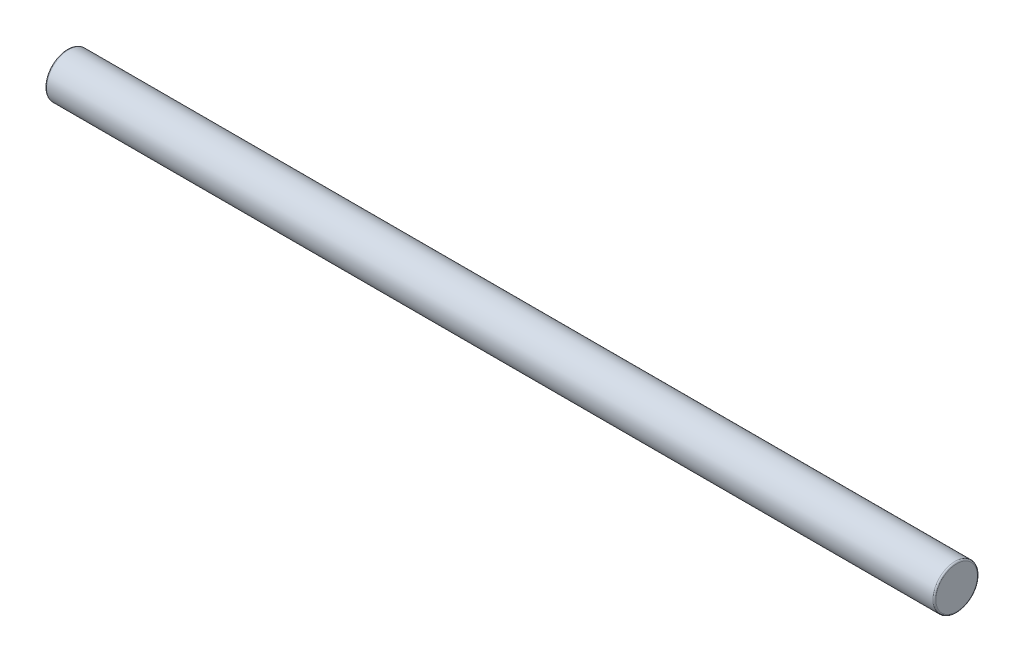
ISO-10303-21;
HEADER;
FILE_DESCRIPTION(('STEP AP214'),'2;1');
FILE_NAME('part.step','',(''),(''),'','','');
FILE_SCHEMA(('AUTOMOTIVE_DESIGN { 1 0 10303 214 1 1 1 1 }'));
ENDSEC;
DATA;
#1=APPLICATION_CONTEXT('core data for automotive mechanical design processes');
#2=APPLICATION_PROTOCOL_DEFINITION('international standard','automotive_design',2000,#1);
#3=PRODUCT_CONTEXT('',#1,'mechanical');
#4=PRODUCT('Part','Part','',(#3));
#5=PRODUCT_RELATED_PRODUCT_CATEGORY('part','',(#4));
#6=PRODUCT_DEFINITION_FORMATION('','',#4);
#7=PRODUCT_DEFINITION_CONTEXT('part definition',#1,'design');
#8=PRODUCT_DEFINITION('design','',#6,#7);
#9=PRODUCT_DEFINITION_SHAPE('','',#8);
#10=(LENGTH_UNIT() NAMED_UNIT(*) SI_UNIT(.MILLI.,.METRE.));
#11=(NAMED_UNIT(*) PLANE_ANGLE_UNIT() SI_UNIT($,.RADIAN.));
#12=(NAMED_UNIT(*) SI_UNIT($,.STERADIAN.) SOLID_ANGLE_UNIT());
#13=UNCERTAINTY_MEASURE_WITH_UNIT(LENGTH_MEASURE(1.E-05),#10,'distance_accuracy_value','');
#14=(GEOMETRIC_REPRESENTATION_CONTEXT(3) GLOBAL_UNCERTAINTY_ASSIGNED_CONTEXT((#13)) GLOBAL_UNIT_ASSIGNED_CONTEXT((#10,
#11,#12)) REPRESENTATION_CONTEXT('',''));
#15=CARTESIAN_POINT('',(0.,0.,0.));
#16=DIRECTION('',(0.,0.,1.));
#17=DIRECTION('',(1.,0.,0.));
#18=AXIS2_PLACEMENT_3D('',#15,#16,#17);
#19=CARTESIAN_POINT('',(15.24,0.,0.));
#20=DIRECTION('',(-1.,0.,0.));
#21=DIRECTION('',(0.,0.,1.));
#22=AXIS2_PLACEMENT_3D('',#19,#20,#21);
#23=CYLINDRICAL_SURFACE('',#22,0.380999999999999);
#24=CARTESIAN_POINT('',(0.0254000000000001,0.,0.));
#25=DIRECTION('',(1.,0.,0.));
#26=DIRECTION('',(0.,0.,-1.));
#27=AXIS2_PLACEMENT_3D('',#24,#25,#26);
#28=CIRCLE('',#27,0.380999999999999);
#29=CARTESIAN_POINT('',(0.0254000000000001,0.,-0.380999999999999));
#30=VERTEX_POINT('',#29);
#31=EDGE_CURVE('E43',#30,#30,#28,.T.);
#32=ORIENTED_EDGE('',*,*,#31,.T.);
#33=EDGE_LOOP('',(#32));
#34=FACE_BOUND('',#33,.T.);
#35=CARTESIAN_POINT('',(15.2146,0.,0.));
#36=DIRECTION('',(1.,0.,0.));
#37=DIRECTION('',(0.,0.,-1.));
#38=AXIS2_PLACEMENT_3D('',#35,#36,#37);
#39=CIRCLE('',#38,0.380999999999999);
#40=CARTESIAN_POINT('',(15.2146,0.,-0.380999999999999));
#41=VERTEX_POINT('',#40);
#42=EDGE_CURVE('E47',#41,#41,#39,.F.);
#43=ORIENTED_EDGE('',*,*,#42,.T.);
#44=EDGE_LOOP('',(#43));
#45=FACE_BOUND('',#44,.T.);
#46=ADVANCED_FACE('F32',(#34,#45),#23,.T.);
#47=CARTESIAN_POINT('',(15.24,0.,0.));
#48=DIRECTION('',(1.,0.,0.));
#49=DIRECTION('',(0.,0.,-1.));
#50=AXIS2_PLACEMENT_3D('',#47,#48,#49);
#51=PLANE('',#50);
#52=CARTESIAN_POINT('',(15.24,0.,0.));
#53=DIRECTION('',(1.,0.,0.));
#54=DIRECTION('',(0.,0.,-1.));
#55=AXIS2_PLACEMENT_3D('',#52,#53,#54);
#56=CIRCLE('',#55,0.355599999999999);
#57=CARTESIAN_POINT('',(15.24,0.,-0.355599999999999));
#58=VERTEX_POINT('',#57);
#59=EDGE_CURVE('E10',#58,#58,#56,.T.);
#60=ORIENTED_EDGE('',*,*,#59,.T.);
#61=EDGE_LOOP('',(#60));
#62=FACE_BOUND('',#61,.T.);
#63=ADVANCED_FACE('F63',(#62),#51,.T.);
#64=CARTESIAN_POINT('',(0.,0.,0.));
#65=DIRECTION('',(1.,0.,0.));
#66=DIRECTION('',(0.,0.,-1.));
#67=AXIS2_PLACEMENT_3D('',#64,#65,#66);
#68=PLANE('',#67);
#69=CARTESIAN_POINT('',(0.,0.,0.));
#70=DIRECTION('',(1.,0.,0.));
#71=DIRECTION('',(0.,0.,-1.));
#72=AXIS2_PLACEMENT_3D('',#69,#70,#71);
#73=CIRCLE('',#72,0.355599999999999);
#74=CARTESIAN_POINT('',(0.,0.,-0.355599999999999));
#75=VERTEX_POINT('',#74);
#76=EDGE_CURVE('E39',#75,#75,#73,.F.);
#77=ORIENTED_EDGE('',*,*,#76,.T.);
#78=EDGE_LOOP('',(#77));
#79=FACE_BOUND('',#78,.T.);
#80=ADVANCED_FACE('F60',(#79),#68,.F.);
#81=CARTESIAN_POINT('',(0.0254000000000001,0.,0.));
#82=DIRECTION('',(1.,0.,0.));
#83=DIRECTION('',(0.,0.,-1.));
#84=AXIS2_PLACEMENT_3D('',#81,#82,#83);
#85=TOROIDAL_SURFACE('',#84,0.355599999999999,0.0254);
#86=ORIENTED_EDGE('',*,*,#76,.F.);
#87=EDGE_LOOP('',(#86));
#88=FACE_BOUND('',#87,.T.);
#89=ORIENTED_EDGE('',*,*,#31,.F.);
#90=EDGE_LOOP('',(#89));
#91=FACE_BOUND('',#90,.T.);
#92=ADVANCED_FACE('F56',(#88,#91),#85,.T.);
#93=CARTESIAN_POINT('',(15.2146,0.,0.));
#94=DIRECTION('',(1.,0.,0.));
#95=DIRECTION('',(0.,0.,-1.));
#96=AXIS2_PLACEMENT_3D('',#93,#94,#95);
#97=TOROIDAL_SURFACE('',#96,0.355599999999999,0.0254);
#98=ORIENTED_EDGE('',*,*,#42,.F.);
#99=EDGE_LOOP('',(#98));
#100=FACE_BOUND('',#99,.T.);
#101=ORIENTED_EDGE('',*,*,#59,.F.);
#102=EDGE_LOOP('',(#101));
#103=FACE_BOUND('',#102,.T.);
#104=ADVANCED_FACE('F34',(#100,#103),#97,.T.);
#105=CLOSED_SHELL('',(#46,#63,#80,#92,#104));
#106=MANIFOLD_SOLID_BREP('B2',#105);
#107=ADVANCED_BREP_SHAPE_REPRESENTATION('',(#18,#106),#14);
#108=SHAPE_DEFINITION_REPRESENTATION(#9,#107);
ENDSEC;
END-ISO-10303-21;
